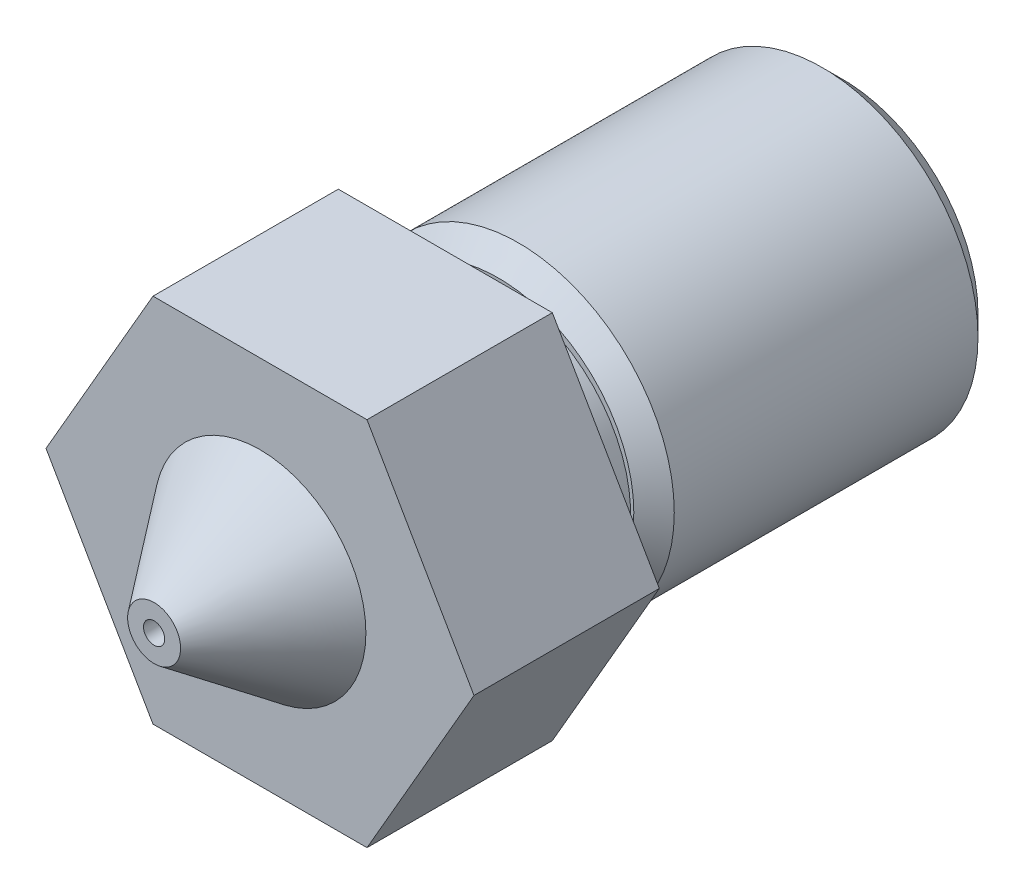
ISO-10303-21;
HEADER;
FILE_DESCRIPTION(('STEP AP214'),'2;1');
FILE_NAME('part.step','',(''),(''),'','','');
FILE_SCHEMA(('AUTOMOTIVE_DESIGN { 1 0 10303 214 1 1 1 1 }'));
ENDSEC;
DATA;
#1=APPLICATION_CONTEXT('core data for automotive mechanical design processes');
#2=APPLICATION_PROTOCOL_DEFINITION('international standard','automotive_design',2000,#1);
#3=PRODUCT_CONTEXT('',#1,'mechanical');
#4=PRODUCT('Part','Part','',(#3));
#5=PRODUCT_RELATED_PRODUCT_CATEGORY('part','',(#4));
#6=PRODUCT_DEFINITION_FORMATION('','',#4);
#7=PRODUCT_DEFINITION_CONTEXT('part definition',#1,'design');
#8=PRODUCT_DEFINITION('design','',#6,#7);
#9=PRODUCT_DEFINITION_SHAPE('','',#8);
#10=(LENGTH_UNIT() NAMED_UNIT(*) SI_UNIT(.MILLI.,.METRE.));
#11=(NAMED_UNIT(*) PLANE_ANGLE_UNIT() SI_UNIT($,.RADIAN.));
#12=(NAMED_UNIT(*) SI_UNIT($,.STERADIAN.) SOLID_ANGLE_UNIT());
#13=UNCERTAINTY_MEASURE_WITH_UNIT(LENGTH_MEASURE(1.E-05),#10,'distance_accuracy_value','');
#14=(GEOMETRIC_REPRESENTATION_CONTEXT(3) GLOBAL_UNCERTAINTY_ASSIGNED_CONTEXT((#13)) GLOBAL_UNIT_ASSIGNED_CONTEXT((#10,
#11,#12)) REPRESENTATION_CONTEXT('',''));
#15=CARTESIAN_POINT('',(0.,0.,0.));
#16=DIRECTION('',(0.,0.,1.));
#17=DIRECTION('',(1.,0.,0.));
#18=AXIS2_PLACEMENT_3D('',#15,#16,#17);
#19=CARTESIAN_POINT('',(0.,0.,-7.28));
#20=DIRECTION('',(0.,0.,1.));
#21=DIRECTION('',(1.,0.,0.));
#22=AXIS2_PLACEMENT_3D('',#19,#20,#21);
#23=CONICAL_SURFACE('',#22,2.78,0.785398163397448);
#24=CARTESIAN_POINT('',(0.,0.,-7.5));
#25=DIRECTION('',(0.,0.,1.));
#26=DIRECTION('',(1.,0.,0.));
#27=AXIS2_PLACEMENT_3D('',#24,#25,#26);
#28=CIRCLE('',#27,2.56);
#29=CARTESIAN_POINT('',(-2.56,0.,-7.5));
#30=VERTEX_POINT('',#29);
#31=EDGE_CURVE('E11',#30,#30,#28,.T.);
#32=ORIENTED_EDGE('',*,*,#31,.T.);
#33=DIRECTION('',(-0.707106781186547,0.,0.707106781186548));
#34=VECTOR('',#33,1.);
#35=CARTESIAN_POINT('',(-2.78,0.,-7.28));
#36=LINE('',#35,#34);
#37=CARTESIAN_POINT('',(-2.942,0.,-7.118));
#38=VERTEX_POINT('',#37);
#39=EDGE_CURVE('E27',#30,#38,#36,.T.);
#40=ORIENTED_EDGE('',*,*,#39,.T.);
#41=CARTESIAN_POINT('',(0.,0.,-7.118));
#42=DIRECTION('',(0.,0.,-1.));
#43=DIRECTION('',(1.,0.,0.));
#44=AXIS2_PLACEMENT_3D('',#41,#42,#43);
#45=CIRCLE('',#44,2.942);
#46=EDGE_CURVE('E245',#38,#38,#45,.T.);
#47=ORIENTED_EDGE('',*,*,#46,.T.);
#48=ORIENTED_EDGE('',*,*,#39,.F.);
#49=EDGE_LOOP('',(#32,#40,#47,#48));
#50=FACE_BOUND('',#49,.T.);
#51=ADVANCED_FACE('F16',(#50),#23,.T.);
#52=CARTESIAN_POINT('',(0.,0.,0.));
#53=DIRECTION('',(0.,0.,-1.));
#54=DIRECTION('',(1.,0.,0.));
#55=AXIS2_PLACEMENT_3D('',#52,#53,#54);
#56=CYLINDRICAL_SURFACE('',#55,2.942);
#57=ORIENTED_EDGE('',*,*,#46,.F.);
#58=DIRECTION('',(0.,0.,1.));
#59=VECTOR('',#58,1.);
#60=CARTESIAN_POINT('',(-2.942,0.,0.));
#61=LINE('',#60,#59);
#62=CARTESIAN_POINT('',(-2.942,0.,-1.382));
#63=VERTEX_POINT('',#62);
#64=EDGE_CURVE('E241',#38,#63,#61,.T.);
#65=ORIENTED_EDGE('',*,*,#64,.T.);
#66=CARTESIAN_POINT('',(0.,0.,-1.382));
#67=DIRECTION('',(0.,0.,1.));
#68=DIRECTION('',(1.,0.,0.));
#69=AXIS2_PLACEMENT_3D('',#66,#67,#68);
#70=CIRCLE('',#69,2.942);
#71=EDGE_CURVE('E219',#63,#63,#70,.T.);
#72=ORIENTED_EDGE('',*,*,#71,.F.);
#73=ORIENTED_EDGE('',*,*,#64,.F.);
#74=EDGE_LOOP('',(#57,#65,#72,#73));
#75=FACE_BOUND('',#74,.T.);
#76=ADVANCED_FACE('F345',(#75),#56,.T.);
#77=CARTESIAN_POINT('',(0.,0.,-7.5));
#78=DIRECTION('',(0.,0.,-1.));
#79=DIRECTION('',(0.,-1.,0.));
#80=AXIS2_PLACEMENT_3D('',#77,#78,#79);
#81=PLANE('',#80);
#82=ORIENTED_EDGE('',*,*,#31,.F.);
#83=EDGE_LOOP('',(#82));
#84=FACE_BOUND('',#83,.T.);
#85=CARTESIAN_POINT('',(0.,0.,-7.5));
#86=DIRECTION('',(0.,0.,1.));
#87=DIRECTION('',(1.,0.,0.));
#88=AXIS2_PLACEMENT_3D('',#85,#86,#87);
#89=CIRCLE('',#88,1.3);
#90=CARTESIAN_POINT('',(1.3,0.,-7.5));
#91=VERTEX_POINT('',#90);
#92=CARTESIAN_POINT('',(-1.3,0.,-7.5));
#93=VERTEX_POINT('',#92);
#94=EDGE_CURVE('E246',#91,#93,#89,.T.);
#95=ORIENTED_EDGE('',*,*,#94,.T.);
#96=CARTESIAN_POINT('',(0.,0.,-7.5));
#97=DIRECTION('',(0.,0.,1.));
#98=DIRECTION('',(1.,0.,0.));
#99=AXIS2_PLACEMENT_3D('',#96,#97,#98);
#100=CIRCLE('',#99,1.3);
#101=EDGE_CURVE('E223',#93,#91,#100,.T.);
#102=ORIENTED_EDGE('',*,*,#101,.T.);
#103=EDGE_LOOP('',(#95,#102));
#104=FACE_BOUND('',#103,.T.);
#105=ADVANCED_FACE('F351',(#84,#104),#81,.T.);
#106=CARTESIAN_POINT('',(0.,0.,-1.22));
#107=DIRECTION('',(0.,0.,-1.));
#108=DIRECTION('',(1.,0.,0.));
#109=AXIS2_PLACEMENT_3D('',#106,#107,#108);
#110=CONICAL_SURFACE('',#109,2.78,0.785398163397448);
#111=ORIENTED_EDGE('',*,*,#71,.T.);
#112=DIRECTION('',(0.707106781186547,0.,0.707106781186548));
#113=VECTOR('',#112,1.);
#114=CARTESIAN_POINT('',(-2.78,0.,-1.22));
#115=LINE('',#114,#113);
#116=CARTESIAN_POINT('',(-2.56,0.,-1.));
#117=VERTEX_POINT('',#116);
#118=EDGE_CURVE('E201',#63,#117,#115,.T.);
#119=ORIENTED_EDGE('',*,*,#118,.T.);
#120=CARTESIAN_POINT('',(0.,0.,-1.));
#121=DIRECTION('',(0.,0.,-1.));
#122=DIRECTION('',(1.,0.,0.));
#123=AXIS2_PLACEMENT_3D('',#120,#121,#122);
#124=CIRCLE('',#123,2.56);
#125=EDGE_CURVE('E197',#117,#117,#124,.T.);
#126=ORIENTED_EDGE('',*,*,#125,.T.);
#127=ORIENTED_EDGE('',*,*,#118,.F.);
#128=EDGE_LOOP('',(#111,#119,#126,#127));
#129=FACE_BOUND('',#128,.T.);
#130=ADVANCED_FACE('F533',(#129),#110,.T.);
#131=CARTESIAN_POINT('',(0.,0.,-1.));
#132=DIRECTION('',(0.,0.,-1.));
#133=DIRECTION('',(0.,-1.,0.));
#134=AXIS2_PLACEMENT_3D('',#131,#132,#133);
#135=PLANE('',#134);
#136=ORIENTED_EDGE('',*,*,#125,.F.);
#137=EDGE_LOOP('',(#136));
#138=FACE_BOUND('',#137,.T.);
#139=CARTESIAN_POINT('',(0.,-0.0573597982362628,-1.));
#140=DIRECTION('',(0.,0.,1.));
#141=DIRECTION('',(1.,0.,0.));
#142=AXIS2_PLACEMENT_3D('',#139,#140,#141);
#143=CIRCLE('',#142,2.5);
#144=CARTESIAN_POINT('',(-2.5,-0.0573597982362625,-1.));
#145=VERTEX_POINT('',#144);
#146=EDGE_CURVE('E192',#145,#145,#143,.T.);
#147=ORIENTED_EDGE('',*,*,#146,.F.);
#148=EDGE_LOOP('',(#147));
#149=FACE_BOUND('',#148,.T.);
#150=ADVANCED_FACE('F527',(#138,#149),#135,.F.);
#151=CARTESIAN_POINT('',(0.,0.,-7.5));
#152=DIRECTION('',(0.,0.,-1.));
#153=DIRECTION('',(1.,0.,0.));
#154=AXIS2_PLACEMENT_3D('',#151,#152,#153);
#155=CONICAL_SURFACE('',#154,1.3,0.785398163397449);
#156=ORIENTED_EDGE('',*,*,#94,.F.);
#157=ORIENTED_EDGE('',*,*,#101,.F.);
#158=DIRECTION('',(0.707106781186548,0.,0.707106781186547));
#159=VECTOR('',#158,1.);
#160=CARTESIAN_POINT('',(-1.3,0.,-7.5));
#161=LINE('',#160,#159);
#162=CARTESIAN_POINT('',(-1.,0.,-7.2));
#163=VERTEX_POINT('',#162);
#164=EDGE_CURVE('E202',#93,#163,#161,.T.);
#165=ORIENTED_EDGE('',*,*,#164,.T.);
#166=CARTESIAN_POINT('',(0.,0.,-7.2));
#167=DIRECTION('',(0.,0.,-1.));
#168=DIRECTION('',(1.,0.,0.));
#169=AXIS2_PLACEMENT_3D('',#166,#167,#168);
#170=CIRCLE('',#169,1.);
#171=CARTESIAN_POINT('',(1.,0.,-7.2));
#172=VERTEX_POINT('',#171);
#173=EDGE_CURVE('E114',#172,#163,#170,.T.);
#174=ORIENTED_EDGE('',*,*,#173,.F.);
#175=CARTESIAN_POINT('',(0.,0.,-7.2));
#176=DIRECTION('',(0.,0.,-1.));
#177=DIRECTION('',(1.,0.,0.));
#178=AXIS2_PLACEMENT_3D('',#175,#176,#177);
#179=CIRCLE('',#178,1.);
#180=EDGE_CURVE('E228',#163,#172,#179,.T.);
#181=ORIENTED_EDGE('',*,*,#180,.F.);
#182=ORIENTED_EDGE('',*,*,#164,.F.);
#183=EDGE_LOOP('',(#156,#157,#165,#174,#181,#182));
#184=FACE_BOUND('',#183,.T.);
#185=ADVANCED_FACE('F532',(#184),#155,.F.);
#186=CARTESIAN_POINT('',(0.,0.,3.014));
#187=DIRECTION('',(0.,0.,-1.));
#188=DIRECTION('',(1.,0.,0.));
#189=AXIS2_PLACEMENT_3D('',#186,#187,#188);
#190=CYLINDRICAL_SURFACE('',#189,1.);
#191=CARTESIAN_POINT('',(0.,0.,3.014));
#192=DIRECTION('',(0.,0.,1.));
#193=DIRECTION('',(1.,0.,0.));
#194=AXIS2_PLACEMENT_3D('',#191,#192,#193);
#195=CIRCLE('',#194,1.);
#196=CARTESIAN_POINT('',(1.,0.,3.014));
#197=VERTEX_POINT('',#196);
#198=CARTESIAN_POINT('',(-1.,0.,3.014));
#199=VERTEX_POINT('',#198);
#200=EDGE_CURVE('E236',#197,#199,#195,.T.);
#201=ORIENTED_EDGE('',*,*,#200,.T.);
#202=DIRECTION('',(0.,0.,-1.));
#203=VECTOR('',#202,1.);
#204=CARTESIAN_POINT('',(-1.,0.,3.014));
#205=LINE('',#204,#203);
#206=EDGE_CURVE('E240',#199,#163,#205,.T.);
#207=ORIENTED_EDGE('',*,*,#206,.T.);
#208=ORIENTED_EDGE('',*,*,#180,.T.);
#209=ORIENTED_EDGE('',*,*,#173,.T.);
#210=ORIENTED_EDGE('',*,*,#206,.F.);
#211=CARTESIAN_POINT('',(0.,0.,3.014));
#212=DIRECTION('',(0.,0.,1.));
#213=DIRECTION('',(1.,0.,0.));
#214=AXIS2_PLACEMENT_3D('',#211,#212,#213);
#215=CIRCLE('',#214,1.);
#216=EDGE_CURVE('E229',#199,#197,#215,.T.);
#217=ORIENTED_EDGE('',*,*,#216,.T.);
#218=EDGE_LOOP('',(#201,#207,#208,#209,#210,#217));
#219=FACE_BOUND('',#218,.T.);
#220=ADVANCED_FACE('F541',(#219),#190,.F.);
#221=CARTESIAN_POINT('',(0.,0.,3.014));
#222=DIRECTION('',(0.,0.,-1.));
#223=DIRECTION('',(1.,0.,0.));
#224=AXIS2_PLACEMENT_3D('',#221,#222,#223);
#225=CONICAL_SURFACE('',#224,1.,0.5234864993294);
#226=ORIENTED_EDGE('',*,*,#200,.F.);
#227=ORIENTED_EDGE('',*,*,#216,.F.);
#228=DIRECTION('',(0.499902762747606,0.,0.866081536460229));
#229=VECTOR('',#228,1.);
#230=CARTESIAN_POINT('',(-1.,0.,3.014));
#231=LINE('',#230,#229);
#232=CARTESIAN_POINT('',(-0.2,0.,4.4));
#233=VERTEX_POINT('',#232);
#234=EDGE_CURVE('E247',#199,#233,#231,.T.);
#235=ORIENTED_EDGE('',*,*,#234,.T.);
#236=CARTESIAN_POINT('',(0.,0.,4.4));
#237=DIRECTION('',(0.,0.,-1.));
#238=DIRECTION('',(1.,0.,0.));
#239=AXIS2_PLACEMENT_3D('',#236,#237,#238);
#240=CIRCLE('',#239,0.2);
#241=CARTESIAN_POINT('',(0.2,0.,4.4));
#242=VERTEX_POINT('',#241);
#243=EDGE_CURVE('E274',#242,#233,#240,.T.);
#244=ORIENTED_EDGE('',*,*,#243,.F.);
#245=CARTESIAN_POINT('',(0.,0.,4.4));
#246=DIRECTION('',(0.,0.,-1.));
#247=DIRECTION('',(1.,0.,0.));
#248=AXIS2_PLACEMENT_3D('',#245,#246,#247);
#249=CIRCLE('',#248,0.2);
#250=EDGE_CURVE('E276',#233,#242,#249,.T.);
#251=ORIENTED_EDGE('',*,*,#250,.F.);
#252=ORIENTED_EDGE('',*,*,#234,.F.);
#253=EDGE_LOOP('',(#226,#227,#235,#244,#251,#252));
#254=FACE_BOUND('',#253,.T.);
#255=ADVANCED_FACE('F546',(#254),#225,.F.);
#256=CARTESIAN_POINT('',(0.,0.,5.));
#257=DIRECTION('',(0.,0.,-1.));
#258=DIRECTION('',(1.,0.,0.));
#259=AXIS2_PLACEMENT_3D('',#256,#257,#258);
#260=CYLINDRICAL_SURFACE('',#259,0.2);
#261=CARTESIAN_POINT('',(0.,0.,5.5));
#262=DIRECTION('',(0.,0.,-1.));
#263=DIRECTION('',(1.,0.,0.));
#264=AXIS2_PLACEMENT_3D('',#261,#262,#263);
#265=CIRCLE('',#264,0.2);
#266=CARTESIAN_POINT('',(-0.2,0.,5.5));
#267=VERTEX_POINT('',#266);
#268=EDGE_CURVE('E188',#267,#267,#265,.T.);
#269=ORIENTED_EDGE('',*,*,#268,.F.);
#270=DIRECTION('',(0.,0.,-1.));
#271=VECTOR('',#270,1.);
#272=CARTESIAN_POINT('',(-0.2,0.,5.));
#273=LINE('',#272,#271);
#274=EDGE_CURVE('E251',#267,#233,#273,.T.);
#275=ORIENTED_EDGE('',*,*,#274,.T.);
#276=ORIENTED_EDGE('',*,*,#250,.T.);
#277=ORIENTED_EDGE('',*,*,#243,.T.);
#278=ORIENTED_EDGE('',*,*,#274,.F.);
#279=EDGE_LOOP('',(#269,#275,#276,#277,#278));
#280=FACE_BOUND('',#279,.T.);
#281=ADVANCED_FACE('F573',(#280),#260,.F.);
#282=CARTESIAN_POINT('',(0.,-0.0573597982362628,0.));
#283=DIRECTION('',(0.,0.,-1.));
#284=DIRECTION('',(1.,0.,0.));
#285=AXIS2_PLACEMENT_3D('',#282,#283,#284);
#286=CYLINDRICAL_SURFACE('',#285,2.5);
#287=CARTESIAN_POINT('',(0.,-0.0573597982362628,0.));
#288=DIRECTION('',(0.,0.,1.));
#289=DIRECTION('',(1.,0.,0.));
#290=AXIS2_PLACEMENT_3D('',#287,#288,#289);
#291=CIRCLE('',#290,2.5);
#292=CARTESIAN_POINT('',(-2.5,-0.0573597982362625,0.));
#293=VERTEX_POINT('',#292);
#294=EDGE_CURVE('E298',#293,#293,#291,.T.);
#295=ORIENTED_EDGE('',*,*,#294,.F.);
#296=DIRECTION('',(0.,0.,-1.));
#297=VECTOR('',#296,1.);
#298=CARTESIAN_POINT('',(-2.5,-0.0573597982362625,0.));
#299=LINE('',#298,#297);
#300=EDGE_CURVE('E234',#293,#145,#299,.T.);
#301=ORIENTED_EDGE('',*,*,#300,.T.);
#302=ORIENTED_EDGE('',*,*,#146,.T.);
#303=ORIENTED_EDGE('',*,*,#300,.F.);
#304=EDGE_LOOP('',(#295,#301,#302,#303));
#305=FACE_BOUND('',#304,.T.);
#306=ADVANCED_FACE('F578',(#305),#286,.T.);
#307=CARTESIAN_POINT('',(0.,0.,5.5));
#308=DIRECTION('',(0.,0.,-1.));
#309=DIRECTION('',(0.,-1.,0.));
#310=AXIS2_PLACEMENT_3D('',#307,#308,#309);
#311=PLANE('',#310);
#312=CARTESIAN_POINT('',(0.,0.,5.5));
#313=DIRECTION('',(0.,0.,-1.));
#314=DIRECTION('',(1.,0.,0.));
#315=AXIS2_PLACEMENT_3D('',#312,#313,#314);
#316=CIRCLE('',#315,0.5);
#317=CARTESIAN_POINT('',(0.5,0.,5.5));
#318=VERTEX_POINT('',#317);
#319=EDGE_CURVE('E193',#318,#318,#316,.T.);
#320=ORIENTED_EDGE('',*,*,#319,.F.);
#321=EDGE_LOOP('',(#320));
#322=FACE_BOUND('',#321,.T.);
#323=ORIENTED_EDGE('',*,*,#268,.T.);
#324=EDGE_LOOP('',(#323));
#325=FACE_BOUND('',#324,.T.);
#326=ADVANCED_FACE('F624',(#322,#325),#311,.F.);
#327=CARTESIAN_POINT('',(0.,0.,3.5));
#328=DIRECTION('',(0.,0.,-1.));
#329=DIRECTION('',(-1.,0.,0.));
#330=AXIS2_PLACEMENT_3D('',#327,#328,#329);
#331=CONICAL_SURFACE('',#330,2.,0.643501108793284);
#332=ORIENTED_EDGE('',*,*,#319,.T.);
#333=DIRECTION('',(0.6,0.,-0.8));
#334=VECTOR('',#333,1.);
#335=CARTESIAN_POINT('',(2.,0.,3.5));
#336=LINE('',#335,#334);
#337=CARTESIAN_POINT('',(2.,0.,3.5));
#338=VERTEX_POINT('',#337);
#339=EDGE_CURVE('E208',#318,#338,#336,.T.);
#340=ORIENTED_EDGE('',*,*,#339,.T.);
#341=CARTESIAN_POINT('',(0.,0.,3.5));
#342=DIRECTION('',(0.,0.,-1.));
#343=DIRECTION('',(-1.,0.,0.));
#344=AXIS2_PLACEMENT_3D('',#341,#342,#343);
#345=CIRCLE('',#344,2.);
#346=CARTESIAN_POINT('',(-2.,0.,3.5));
#347=VERTEX_POINT('',#346);
#348=EDGE_CURVE('E257',#347,#338,#345,.T.);
#349=ORIENTED_EDGE('',*,*,#348,.F.);
#350=CARTESIAN_POINT('',(0.,0.,3.5));
#351=DIRECTION('',(0.,0.,-1.));
#352=DIRECTION('',(-1.,0.,0.));
#353=AXIS2_PLACEMENT_3D('',#350,#351,#352);
#354=CIRCLE('',#353,2.);
#355=EDGE_CURVE('E260',#338,#347,#354,.T.);
#356=ORIENTED_EDGE('',*,*,#355,.F.);
#357=ORIENTED_EDGE('',*,*,#339,.F.);
#358=EDGE_LOOP('',(#332,#340,#349,#356,#357));
#359=FACE_BOUND('',#358,.T.);
#360=ADVANCED_FACE('F629',(#359),#331,.T.);
#361=CARTESIAN_POINT('',(-2.02072594216369,-3.5,0.));
#362=DIRECTION('',(0.,-1.,0.));
#363=DIRECTION('',(-1.,0.,0.));
#364=AXIS2_PLACEMENT_3D('',#361,#362,#363);
#365=PLANE('',#364);
#366=DIRECTION('',(1.,0.,0.));
#367=VECTOR('',#366,1.);
#368=CARTESIAN_POINT('',(-2.02072594216369,-3.5,0.));
#369=LINE('',#368,#367);
#370=CARTESIAN_POINT('',(-2.02072594216369,-3.5,0.));
#371=VERTEX_POINT('',#370);
#372=CARTESIAN_POINT('',(2.02072594216369,-3.5,0.));
#373=VERTEX_POINT('',#372);
#374=EDGE_CURVE('E212',#371,#373,#369,.T.);
#375=ORIENTED_EDGE('',*,*,#374,.T.);
#376=DIRECTION('',(0.,0.,1.));
#377=VECTOR('',#376,1.);
#378=CARTESIAN_POINT('',(2.02072594216369,-3.5,0.));
#379=LINE('',#378,#377);
#380=CARTESIAN_POINT('',(2.02072594216369,-3.5,3.5));
#381=VERTEX_POINT('',#380);
#382=EDGE_CURVE('E252',#373,#381,#379,.T.);
#383=ORIENTED_EDGE('',*,*,#382,.T.);
#384=DIRECTION('',(1.,0.,0.));
#385=VECTOR('',#384,1.);
#386=CARTESIAN_POINT('',(-2.02072594216369,-3.5,3.5));
#387=LINE('',#386,#385);
#388=CARTESIAN_POINT('',(-2.02072594216369,-3.5,3.5));
#389=VERTEX_POINT('',#388);
#390=EDGE_CURVE('E207',#389,#381,#387,.T.);
#391=ORIENTED_EDGE('',*,*,#390,.F.);
#392=DIRECTION('',(0.,0.,1.));
#393=VECTOR('',#392,1.);
#394=CARTESIAN_POINT('',(-2.02072594216369,-3.5,0.));
#395=LINE('',#394,#393);
#396=EDGE_CURVE('E264',#371,#389,#395,.T.);
#397=ORIENTED_EDGE('',*,*,#396,.F.);
#398=EDGE_LOOP('',(#375,#383,#391,#397));
#399=FACE_BOUND('',#398,.T.);
#400=ADVANCED_FACE('F325',(#399),#365,.T.);
#401=CARTESIAN_POINT('',(-4.04145188432738,0.,0.));
#402=DIRECTION('',(-0.866025403784439,-0.5,0.));
#403=DIRECTION('',(-0.5,0.866025403784439,0.));
#404=AXIS2_PLACEMENT_3D('',#401,#402,#403);
#405=PLANE('',#404);
#406=DIRECTION('',(0.5,-0.866025403784439,0.));
#407=VECTOR('',#406,1.);
#408=CARTESIAN_POINT('',(-4.04145188432738,0.,0.));
#409=LINE('',#408,#407);
#410=CARTESIAN_POINT('',(-4.04145188432738,0.,0.));
#411=VERTEX_POINT('',#410);
#412=EDGE_CURVE('E255',#411,#371,#409,.T.);
#413=ORIENTED_EDGE('',*,*,#412,.T.);
#414=ORIENTED_EDGE('',*,*,#396,.T.);
#415=DIRECTION('',(0.5,-0.866025403784439,0.));
#416=VECTOR('',#415,1.);
#417=CARTESIAN_POINT('',(-4.04145188432738,0.,3.5));
#418=LINE('',#417,#416);
#419=CARTESIAN_POINT('',(-4.04145188432738,0.,3.5));
#420=VERTEX_POINT('',#419);
#421=EDGE_CURVE('E203',#420,#389,#418,.T.);
#422=ORIENTED_EDGE('',*,*,#421,.F.);
#423=DIRECTION('',(0.,0.,1.));
#424=VECTOR('',#423,1.);
#425=CARTESIAN_POINT('',(-4.04145188432738,0.,0.));
#426=LINE('',#425,#424);
#427=EDGE_CURVE('E213',#411,#420,#426,.T.);
#428=ORIENTED_EDGE('',*,*,#427,.F.);
#429=EDGE_LOOP('',(#413,#414,#422,#428));
#430=FACE_BOUND('',#429,.T.);
#431=ADVANCED_FACE('F18',(#430),#405,.T.);
#432=CARTESIAN_POINT('',(-2.02072594216369,3.5,0.));
#433=DIRECTION('',(-0.866025403784439,0.5,0.));
#434=DIRECTION('',(0.,0.,1.));
#435=AXIS2_PLACEMENT_3D('',#432,#433,#434);
#436=PLANE('',#435);
#437=DIRECTION('',(-0.5,-0.866025403784439,0.));
#438=VECTOR('',#437,1.);
#439=CARTESIAN_POINT('',(-2.02072594216369,3.5,0.));
#440=LINE('',#439,#438);
#441=CARTESIAN_POINT('',(-2.02072594216369,3.5,0.));
#442=VERTEX_POINT('',#441);
#443=EDGE_CURVE('E217',#442,#411,#440,.T.);
#444=ORIENTED_EDGE('',*,*,#443,.T.);
#445=ORIENTED_EDGE('',*,*,#427,.T.);
#446=DIRECTION('',(-0.5,-0.866025403784439,0.));
#447=VECTOR('',#446,1.);
#448=CARTESIAN_POINT('',(-2.02072594216369,3.5,3.5));
#449=LINE('',#448,#447);
#450=CARTESIAN_POINT('',(-2.02072594216369,3.5,3.5));
#451=VERTEX_POINT('',#450);
#452=EDGE_CURVE('E162',#451,#420,#449,.T.);
#453=ORIENTED_EDGE('',*,*,#452,.F.);
#454=DIRECTION('',(0.,0.,1.));
#455=VECTOR('',#454,1.);
#456=CARTESIAN_POINT('',(-2.02072594216369,3.5,0.));
#457=LINE('',#456,#455);
#458=EDGE_CURVE('E156',#442,#451,#457,.T.);
#459=ORIENTED_EDGE('',*,*,#458,.F.);
#460=EDGE_LOOP('',(#444,#445,#453,#459));
#461=FACE_BOUND('',#460,.T.);
#462=ADVANCED_FACE('F501',(#461),#436,.T.);
#463=CARTESIAN_POINT('',(2.02072594216369,3.5,0.));
#464=DIRECTION('',(0.,1.,0.));
#465=DIRECTION('',(1.,0.,0.));
#466=AXIS2_PLACEMENT_3D('',#463,#464,#465);
#467=PLANE('',#466);
#468=DIRECTION('',(-1.,0.,0.));
#469=VECTOR('',#468,1.);
#470=CARTESIAN_POINT('',(2.02072594216369,3.5,0.));
#471=LINE('',#470,#469);
#472=CARTESIAN_POINT('',(2.02072594216369,3.5,0.));
#473=VERTEX_POINT('',#472);
#474=EDGE_CURVE('E218',#473,#442,#471,.T.);
#475=ORIENTED_EDGE('',*,*,#474,.T.);
#476=ORIENTED_EDGE('',*,*,#458,.T.);
#477=DIRECTION('',(-1.,0.,0.));
#478=VECTOR('',#477,1.);
#479=CARTESIAN_POINT('',(2.02072594216369,3.5,3.5));
#480=LINE('',#479,#478);
#481=CARTESIAN_POINT('',(2.02072594216369,3.5,3.5));
#482=VERTEX_POINT('',#481);
#483=EDGE_CURVE('E150',#482,#451,#480,.T.);
#484=ORIENTED_EDGE('',*,*,#483,.F.);
#485=DIRECTION('',(0.,0.,1.));
#486=VECTOR('',#485,1.);
#487=CARTESIAN_POINT('',(2.02072594216369,3.5,0.));
#488=LINE('',#487,#486);
#489=EDGE_CURVE('E154',#473,#482,#488,.T.);
#490=ORIENTED_EDGE('',*,*,#489,.F.);
#491=EDGE_LOOP('',(#475,#476,#484,#490));
#492=FACE_BOUND('',#491,.T.);
#493=ADVANCED_FACE('F153',(#492),#467,.T.);
#494=CARTESIAN_POINT('',(4.04145188432738,0.,0.));
#495=DIRECTION('',(0.866025403784439,0.5,0.));
#496=DIRECTION('',(0.,0.,-1.));
#497=AXIS2_PLACEMENT_3D('',#494,#495,#496);
#498=PLANE('',#497);
#499=DIRECTION('',(-0.5,0.866025403784439,0.));
#500=VECTOR('',#499,1.);
#501=CARTESIAN_POINT('',(4.04145188432738,0.,0.));
#502=LINE('',#501,#500);
#503=CARTESIAN_POINT('',(4.04145188432738,0.,0.));
#504=VERTEX_POINT('',#503);
#505=EDGE_CURVE('E20',#504,#473,#502,.T.);
#506=ORIENTED_EDGE('',*,*,#505,.T.);
#507=ORIENTED_EDGE('',*,*,#489,.T.);
#508=DIRECTION('',(-0.5,0.866025403784439,0.));
#509=VECTOR('',#508,1.);
#510=CARTESIAN_POINT('',(4.04145188432738,0.,3.5));
#511=LINE('',#510,#509);
#512=CARTESIAN_POINT('',(4.04145188432738,0.,3.5));
#513=VERTEX_POINT('',#512);
#514=EDGE_CURVE('E161',#513,#482,#511,.T.);
#515=ORIENTED_EDGE('',*,*,#514,.F.);
#516=DIRECTION('',(0.,0.,1.));
#517=VECTOR('',#516,1.);
#518=CARTESIAN_POINT('',(4.04145188432738,0.,0.));
#519=LINE('',#518,#517);
#520=EDGE_CURVE('E183',#504,#513,#519,.T.);
#521=ORIENTED_EDGE('',*,*,#520,.F.);
#522=EDGE_LOOP('',(#506,#507,#515,#521));
#523=FACE_BOUND('',#522,.T.);
#524=ADVANCED_FACE('F166',(#523),#498,.T.);
#525=CARTESIAN_POINT('',(2.02072594216369,-3.5,0.));
#526=DIRECTION('',(0.866025403784439,-0.5,0.));
#527=DIRECTION('',(0.,0.,-1.));
#528=AXIS2_PLACEMENT_3D('',#525,#526,#527);
#529=PLANE('',#528);
#530=DIRECTION('',(0.5,0.866025403784439,0.));
#531=VECTOR('',#530,1.);
#532=CARTESIAN_POINT('',(2.02072594216369,-3.5,0.));
#533=LINE('',#532,#531);
#534=EDGE_CURVE('E170',#373,#504,#533,.T.);
#535=ORIENTED_EDGE('',*,*,#534,.T.);
#536=ORIENTED_EDGE('',*,*,#520,.T.);
#537=DIRECTION('',(0.5,0.866025403784439,0.));
#538=VECTOR('',#537,1.);
#539=CARTESIAN_POINT('',(2.02072594216369,-3.5,3.5));
#540=LINE('',#539,#538);
#541=EDGE_CURVE('E176',#381,#513,#540,.T.);
#542=ORIENTED_EDGE('',*,*,#541,.F.);
#543=ORIENTED_EDGE('',*,*,#382,.F.);
#544=EDGE_LOOP('',(#535,#536,#542,#543));
#545=FACE_BOUND('',#544,.T.);
#546=ADVANCED_FACE('F333',(#545),#529,.T.);
#547=CARTESIAN_POINT('',(0.,0.,3.5));
#548=DIRECTION('',(0.,0.,1.));
#549=DIRECTION('',(1.,0.,0.));
#550=AXIS2_PLACEMENT_3D('',#547,#548,#549);
#551=PLANE('',#550);
#552=ORIENTED_EDGE('',*,*,#541,.T.);
#553=ORIENTED_EDGE('',*,*,#514,.T.);
#554=ORIENTED_EDGE('',*,*,#483,.T.);
#555=ORIENTED_EDGE('',*,*,#452,.T.);
#556=ORIENTED_EDGE('',*,*,#421,.T.);
#557=ORIENTED_EDGE('',*,*,#390,.T.);
#558=EDGE_LOOP('',(#552,#553,#554,#555,#556,#557));
#559=FACE_BOUND('',#558,.T.);
#560=ORIENTED_EDGE('',*,*,#348,.T.);
#561=ORIENTED_EDGE('',*,*,#355,.T.);
#562=EDGE_LOOP('',(#560,#561));
#563=FACE_BOUND('',#562,.T.);
#564=ADVANCED_FACE('F173',(#559,#563),#551,.T.);
#565=CARTESIAN_POINT('',(0.,0.,0.));
#566=DIRECTION('',(0.,0.,1.));
#567=DIRECTION('',(1.,0.,0.));
#568=AXIS2_PLACEMENT_3D('',#565,#566,#567);
#569=PLANE('',#568);
#570=ORIENTED_EDGE('',*,*,#534,.F.);
#571=ORIENTED_EDGE('',*,*,#374,.F.);
#572=ORIENTED_EDGE('',*,*,#412,.F.);
#573=ORIENTED_EDGE('',*,*,#443,.F.);
#574=ORIENTED_EDGE('',*,*,#474,.F.);
#575=ORIENTED_EDGE('',*,*,#505,.F.);
#576=EDGE_LOOP('',(#570,#571,#572,#573,#574,#575));
#577=FACE_BOUND('',#576,.T.);
#578=ORIENTED_EDGE('',*,*,#294,.T.);
#579=EDGE_LOOP('',(#578));
#580=FACE_BOUND('',#579,.T.);
#581=ADVANCED_FACE('F330',(#577,#580),#569,.F.);
#582=CLOSED_SHELL('',(#51,#76,#105,#130,#150,#185,#220,#255,#281,#306,#326,#360,#400,#431,#462,
#493,#524,#546,#564,#581));
#583=MANIFOLD_SOLID_BREP('B1',#582);
#584=ADVANCED_BREP_SHAPE_REPRESENTATION('',(#18,#583),#14);
#585=SHAPE_DEFINITION_REPRESENTATION(#9,#584);
ENDSEC;
END-ISO-10303-21;
